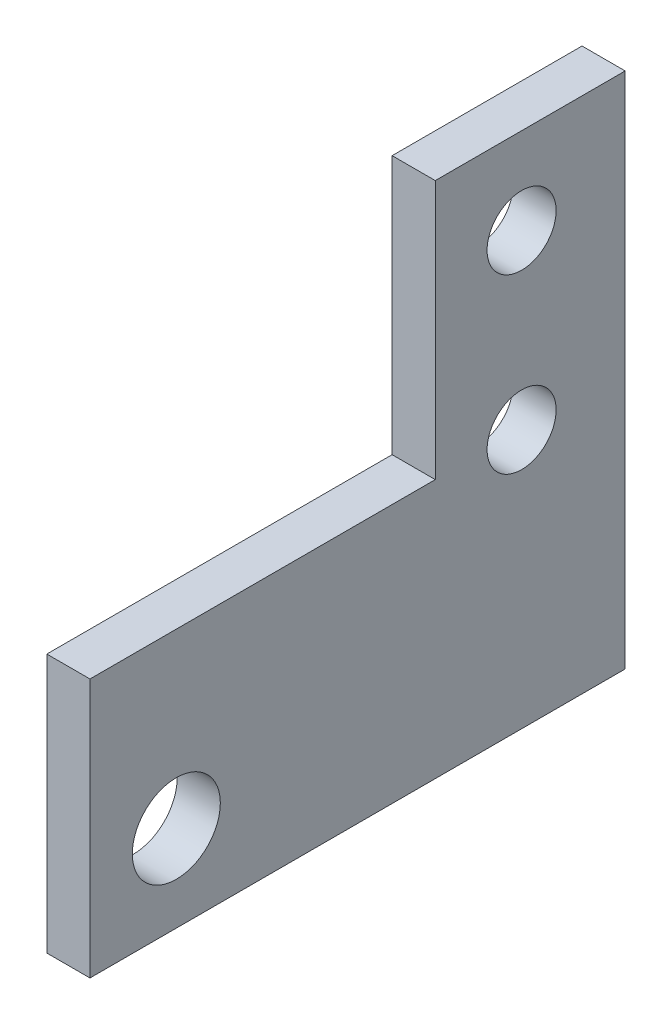
ISO-10303-21;
HEADER;
FILE_DESCRIPTION(('STEP AP214'),'2;1');
FILE_NAME('part.step','',(''),(''),'','','');
FILE_SCHEMA(('AUTOMOTIVE_DESIGN { 1 0 10303 214 1 1 1 1 }'));
ENDSEC;
DATA;
#1=APPLICATION_CONTEXT('core data for automotive mechanical design processes');
#2=APPLICATION_PROTOCOL_DEFINITION('international standard','automotive_design',2000,#1);
#3=PRODUCT_CONTEXT('',#1,'mechanical');
#4=PRODUCT('Part','Part','',(#3));
#5=PRODUCT_RELATED_PRODUCT_CATEGORY('part','',(#4));
#6=PRODUCT_DEFINITION_FORMATION('','',#4);
#7=PRODUCT_DEFINITION_CONTEXT('part definition',#1,'design');
#8=PRODUCT_DEFINITION('design','',#6,#7);
#9=PRODUCT_DEFINITION_SHAPE('','',#8);
#10=(LENGTH_UNIT() NAMED_UNIT(*) SI_UNIT(.MILLI.,.METRE.));
#11=(NAMED_UNIT(*) PLANE_ANGLE_UNIT() SI_UNIT($,.RADIAN.));
#12=(NAMED_UNIT(*) SI_UNIT($,.STERADIAN.) SOLID_ANGLE_UNIT());
#13=UNCERTAINTY_MEASURE_WITH_UNIT(LENGTH_MEASURE(1.E-05),#10,'distance_accuracy_value','');
#14=(GEOMETRIC_REPRESENTATION_CONTEXT(3) GLOBAL_UNCERTAINTY_ASSIGNED_CONTEXT((#13)) GLOBAL_UNIT_ASSIGNED_CONTEXT((#10,
#11,#12)) REPRESENTATION_CONTEXT('',''));
#15=CARTESIAN_POINT('',(0.,0.,0.));
#16=DIRECTION('',(0.,0.,1.));
#17=DIRECTION('',(1.,0.,0.));
#18=AXIS2_PLACEMENT_3D('',#15,#16,#17);
#19=CARTESIAN_POINT('',(5.,0.,0.));
#20=DIRECTION('',(1.,0.,0.));
#21=DIRECTION('',(0.,0.,-1.));
#22=AXIS2_PLACEMENT_3D('',#19,#20,#21);
#23=PLANE('',#22);
#24=CARTESIAN_POINT('',(5.,20.,-40.));
#25=DIRECTION('',(1.,0.,0.));
#26=DIRECTION('',(0.,0.,-1.));
#27=AXIS2_PLACEMENT_3D('',#24,#25,#26);
#28=CIRCLE('',#27,4.00000000000001);
#29=CARTESIAN_POINT('',(5.,20.,-44.));
#30=VERTEX_POINT('',#29);
#31=EDGE_CURVE('E184',#30,#30,#28,.T.);
#32=ORIENTED_EDGE('',*,*,#31,.F.);
#33=EDGE_LOOP('',(#32));
#34=FACE_BOUND('',#33,.T.);
#35=DIRECTION('',(0.,0.,1.));
#36=VECTOR('',#35,1.);
#37=CARTESIAN_POINT('',(5.,20.,-30.));
#38=LINE('',#37,#36);
#39=CARTESIAN_POINT('',(5.,20.,-30.));
#40=VERTEX_POINT('',#39);
#41=CARTESIAN_POINT('',(5.,20.,10.));
#42=VERTEX_POINT('',#41);
#43=EDGE_CURVE('E129',#40,#42,#38,.T.);
#44=ORIENTED_EDGE('',*,*,#43,.T.);
#45=DIRECTION('',(0.,-1.,0.));
#46=VECTOR('',#45,1.);
#47=CARTESIAN_POINT('',(5.,20.,10.));
#48=LINE('',#47,#46);
#49=CARTESIAN_POINT('',(5.,-9.99999999999999,10.));
#50=VERTEX_POINT('',#49);
#51=EDGE_CURVE('E87',#42,#50,#48,.T.);
#52=ORIENTED_EDGE('',*,*,#51,.T.);
#53=DIRECTION('',(0.,0.,-1.));
#54=VECTOR('',#53,1.);
#55=CARTESIAN_POINT('',(5.,-9.99999999999999,10.));
#56=LINE('',#55,#54);
#57=CARTESIAN_POINT('',(5.,-9.99999999999999,-52.));
#58=VERTEX_POINT('',#57);
#59=EDGE_CURVE('E100',#50,#58,#56,.T.);
#60=ORIENTED_EDGE('',*,*,#59,.T.);
#61=DIRECTION('',(0.,1.,0.));
#62=VECTOR('',#61,1.);
#63=CARTESIAN_POINT('',(5.,-9.99999999999999,-52.));
#64=LINE('',#63,#62);
#65=CARTESIAN_POINT('',(5.,50.,-52.));
#66=VERTEX_POINT('',#65);
#67=EDGE_CURVE('E94',#58,#66,#64,.T.);
#68=ORIENTED_EDGE('',*,*,#67,.T.);
#69=DIRECTION('',(0.,0.,1.));
#70=VECTOR('',#69,1.);
#71=CARTESIAN_POINT('',(5.,50.,-52.));
#72=LINE('',#71,#70);
#73=CARTESIAN_POINT('',(5.,50.,-30.));
#74=VERTEX_POINT('',#73);
#75=EDGE_CURVE('E98',#66,#74,#72,.T.);
#76=ORIENTED_EDGE('',*,*,#75,.T.);
#77=DIRECTION('',(0.,-1.,0.));
#78=VECTOR('',#77,1.);
#79=CARTESIAN_POINT('',(5.,50.,-30.));
#80=LINE('',#79,#78);
#81=EDGE_CURVE('E50',#74,#40,#80,.T.);
#82=ORIENTED_EDGE('',*,*,#81,.T.);
#83=EDGE_LOOP('',(#44,#52,#60,#68,#76,#82));
#84=FACE_BOUND('',#83,.T.);
#85=CARTESIAN_POINT('',(5.,40.,-40.));
#86=DIRECTION('',(1.,0.,0.));
#87=DIRECTION('',(0.,0.,-1.));
#88=AXIS2_PLACEMENT_3D('',#85,#86,#87);
#89=CIRCLE('',#88,4.00000000000001);
#90=CARTESIAN_POINT('',(5.,40.,-44.));
#91=VERTEX_POINT('',#90);
#92=EDGE_CURVE('E122',#91,#91,#89,.T.);
#93=ORIENTED_EDGE('',*,*,#92,.F.);
#94=EDGE_LOOP('',(#93));
#95=FACE_BOUND('',#94,.T.);
#96=CARTESIAN_POINT('',(5.,0.,0.));
#97=DIRECTION('',(1.,0.,0.));
#98=DIRECTION('',(0.,0.,-1.));
#99=AXIS2_PLACEMENT_3D('',#96,#97,#98);
#100=CIRCLE('',#99,5.1);
#101=CARTESIAN_POINT('',(5.,0.,-5.1));
#102=VERTEX_POINT('',#101);
#103=EDGE_CURVE('E175',#102,#102,#100,.T.);
#104=ORIENTED_EDGE('',*,*,#103,.F.);
#105=EDGE_LOOP('',(#104));
#106=FACE_BOUND('',#105,.T.);
#107=ADVANCED_FACE('F33',(#34,#84,#95,#106),#23,.T.);
#108=CARTESIAN_POINT('',(0.,0.,0.));
#109=DIRECTION('',(1.,0.,0.));
#110=DIRECTION('',(0.,0.,-1.));
#111=AXIS2_PLACEMENT_3D('',#108,#109,#110);
#112=PLANE('',#111);
#113=DIRECTION('',(0.,0.,1.));
#114=VECTOR('',#113,1.);
#115=CARTESIAN_POINT('',(0.,20.,-30.));
#116=LINE('',#115,#114);
#117=CARTESIAN_POINT('',(0.,20.,-30.));
#118=VERTEX_POINT('',#117);
#119=CARTESIAN_POINT('',(0.,20.,10.));
#120=VERTEX_POINT('',#119);
#121=EDGE_CURVE('E118',#118,#120,#116,.T.);
#122=ORIENTED_EDGE('',*,*,#121,.F.);
#123=DIRECTION('',(0.,-1.,0.));
#124=VECTOR('',#123,1.);
#125=CARTESIAN_POINT('',(0.,50.,-30.));
#126=LINE('',#125,#124);
#127=CARTESIAN_POINT('',(0.,50.,-30.));
#128=VERTEX_POINT('',#127);
#129=EDGE_CURVE('E79',#128,#118,#126,.T.);
#130=ORIENTED_EDGE('',*,*,#129,.F.);
#131=DIRECTION('',(0.,0.,1.));
#132=VECTOR('',#131,1.);
#133=CARTESIAN_POINT('',(0.,50.,-52.));
#134=LINE('',#133,#132);
#135=CARTESIAN_POINT('',(0.,50.,-52.));
#136=VERTEX_POINT('',#135);
#137=EDGE_CURVE('E73',#136,#128,#134,.T.);
#138=ORIENTED_EDGE('',*,*,#137,.F.);
#139=DIRECTION('',(0.,1.,0.));
#140=VECTOR('',#139,1.);
#141=CARTESIAN_POINT('',(0.,-9.99999999999999,-52.));
#142=LINE('',#141,#140);
#143=CARTESIAN_POINT('',(0.,-9.99999999999999,-52.));
#144=VERTEX_POINT('',#143);
#145=EDGE_CURVE('E108',#144,#136,#142,.T.);
#146=ORIENTED_EDGE('',*,*,#145,.F.);
#147=DIRECTION('',(0.,0.,-1.));
#148=VECTOR('',#147,1.);
#149=CARTESIAN_POINT('',(0.,-9.99999999999999,10.));
#150=LINE('',#149,#148);
#151=CARTESIAN_POINT('',(0.,-9.99999999999999,10.));
#152=VERTEX_POINT('',#151);
#153=EDGE_CURVE('E124',#152,#144,#150,.T.);
#154=ORIENTED_EDGE('',*,*,#153,.F.);
#155=DIRECTION('',(0.,-1.,0.));
#156=VECTOR('',#155,1.);
#157=CARTESIAN_POINT('',(0.,20.,10.));
#158=LINE('',#157,#156);
#159=EDGE_CURVE('E121',#120,#152,#158,.T.);
#160=ORIENTED_EDGE('',*,*,#159,.F.);
#161=EDGE_LOOP('',(#122,#130,#138,#146,#154,#160));
#162=FACE_BOUND('',#161,.T.);
#163=CARTESIAN_POINT('',(0.,40.,-40.));
#164=DIRECTION('',(1.,0.,0.));
#165=DIRECTION('',(0.,0.,-1.));
#166=AXIS2_PLACEMENT_3D('',#163,#164,#165);
#167=CIRCLE('',#166,4.00000000000001);
#168=CARTESIAN_POINT('',(0.,40.,-44.));
#169=VERTEX_POINT('',#168);
#170=EDGE_CURVE('E187',#169,#169,#167,.T.);
#171=ORIENTED_EDGE('',*,*,#170,.T.);
#172=EDGE_LOOP('',(#171));
#173=FACE_BOUND('',#172,.T.);
#174=CARTESIAN_POINT('',(0.,20.,-40.));
#175=DIRECTION('',(1.,0.,0.));
#176=DIRECTION('',(0.,0.,-1.));
#177=AXIS2_PLACEMENT_3D('',#174,#175,#176);
#178=CIRCLE('',#177,4.00000000000001);
#179=CARTESIAN_POINT('',(0.,20.,-44.));
#180=VERTEX_POINT('',#179);
#181=EDGE_CURVE('E181',#180,#180,#178,.T.);
#182=ORIENTED_EDGE('',*,*,#181,.T.);
#183=EDGE_LOOP('',(#182));
#184=FACE_BOUND('',#183,.T.);
#185=CARTESIAN_POINT('',(0.,0.,0.));
#186=DIRECTION('',(1.,0.,0.));
#187=DIRECTION('',(0.,0.,-1.));
#188=AXIS2_PLACEMENT_3D('',#185,#186,#187);
#189=CIRCLE('',#188,5.1);
#190=CARTESIAN_POINT('',(0.,0.,-5.1));
#191=VERTEX_POINT('',#190);
#192=EDGE_CURVE('E178',#191,#191,#189,.T.);
#193=ORIENTED_EDGE('',*,*,#192,.T.);
#194=EDGE_LOOP('',(#193));
#195=FACE_BOUND('',#194,.T.);
#196=ADVANCED_FACE('F138',(#162,#173,#184,#195),#112,.F.);
#197=CARTESIAN_POINT('',(5.,20.,-30.));
#198=DIRECTION('',(0.,-1.,0.));
#199=DIRECTION('',(0.,0.,-1.));
#200=AXIS2_PLACEMENT_3D('',#197,#198,#199);
#201=PLANE('',#200);
#202=ORIENTED_EDGE('',*,*,#121,.T.);
#203=DIRECTION('',(-1.,0.,0.));
#204=VECTOR('',#203,1.);
#205=CARTESIAN_POINT('',(5.,20.,10.));
#206=LINE('',#205,#204);
#207=EDGE_CURVE('E11',#42,#120,#206,.T.);
#208=ORIENTED_EDGE('',*,*,#207,.F.);
#209=ORIENTED_EDGE('',*,*,#43,.F.);
#210=DIRECTION('',(-1.,0.,0.));
#211=VECTOR('',#210,1.);
#212=CARTESIAN_POINT('',(5.,20.,-30.));
#213=LINE('',#212,#211);
#214=EDGE_CURVE('E114',#40,#118,#213,.T.);
#215=ORIENTED_EDGE('',*,*,#214,.T.);
#216=EDGE_LOOP('',(#202,#208,#209,#215));
#217=FACE_BOUND('',#216,.T.);
#218=ADVANCED_FACE('F35',(#217),#201,.F.);
#219=CARTESIAN_POINT('',(5.,20.,10.));
#220=DIRECTION('',(0.,0.,-1.));
#221=DIRECTION('',(-1.,0.,0.));
#222=AXIS2_PLACEMENT_3D('',#219,#220,#221);
#223=PLANE('',#222);
#224=ORIENTED_EDGE('',*,*,#159,.T.);
#225=DIRECTION('',(-1.,0.,0.));
#226=VECTOR('',#225,1.);
#227=CARTESIAN_POINT('',(5.,-9.99999999999999,10.));
#228=LINE('',#227,#226);
#229=EDGE_CURVE('E42',#50,#152,#228,.T.);
#230=ORIENTED_EDGE('',*,*,#229,.F.);
#231=ORIENTED_EDGE('',*,*,#51,.F.);
#232=ORIENTED_EDGE('',*,*,#207,.T.);
#233=EDGE_LOOP('',(#224,#230,#231,#232));
#234=FACE_BOUND('',#233,.T.);
#235=ADVANCED_FACE('F237',(#234),#223,.F.);
#236=CARTESIAN_POINT('',(5.,-9.99999999999999,10.));
#237=DIRECTION('',(0.,1.,0.));
#238=DIRECTION('',(0.,0.,1.));
#239=AXIS2_PLACEMENT_3D('',#236,#237,#238);
#240=PLANE('',#239);
#241=ORIENTED_EDGE('',*,*,#153,.T.);
#242=DIRECTION('',(-1.,0.,0.));
#243=VECTOR('',#242,1.);
#244=CARTESIAN_POINT('',(5.,-9.99999999999999,-52.));
#245=LINE('',#244,#243);
#246=EDGE_CURVE('E109',#58,#144,#245,.T.);
#247=ORIENTED_EDGE('',*,*,#246,.F.);
#248=ORIENTED_EDGE('',*,*,#59,.F.);
#249=ORIENTED_EDGE('',*,*,#229,.T.);
#250=EDGE_LOOP('',(#241,#247,#248,#249));
#251=FACE_BOUND('',#250,.T.);
#252=ADVANCED_FACE('F135',(#251),#240,.F.);
#253=CARTESIAN_POINT('',(5.,-9.99999999999999,-52.));
#254=DIRECTION('',(0.,0.,1.));
#255=DIRECTION('',(0.,-1.,0.));
#256=AXIS2_PLACEMENT_3D('',#253,#254,#255);
#257=PLANE('',#256);
#258=ORIENTED_EDGE('',*,*,#145,.T.);
#259=DIRECTION('',(-1.,0.,0.));
#260=VECTOR('',#259,1.);
#261=CARTESIAN_POINT('',(5.,50.,-52.));
#262=LINE('',#261,#260);
#263=EDGE_CURVE('E105',#66,#136,#262,.T.);
#264=ORIENTED_EDGE('',*,*,#263,.F.);
#265=ORIENTED_EDGE('',*,*,#67,.F.);
#266=ORIENTED_EDGE('',*,*,#246,.T.);
#267=EDGE_LOOP('',(#258,#264,#265,#266));
#268=FACE_BOUND('',#267,.T.);
#269=ADVANCED_FACE('F106',(#268),#257,.F.);
#270=CARTESIAN_POINT('',(5.,50.,-52.));
#271=DIRECTION('',(0.,-1.,0.));
#272=DIRECTION('',(0.,0.,-1.));
#273=AXIS2_PLACEMENT_3D('',#270,#271,#272);
#274=PLANE('',#273);
#275=ORIENTED_EDGE('',*,*,#137,.T.);
#276=DIRECTION('',(-1.,0.,0.));
#277=VECTOR('',#276,1.);
#278=CARTESIAN_POINT('',(5.,50.,-30.));
#279=LINE('',#278,#277);
#280=EDGE_CURVE('E110',#74,#128,#279,.T.);
#281=ORIENTED_EDGE('',*,*,#280,.F.);
#282=ORIENTED_EDGE('',*,*,#75,.F.);
#283=ORIENTED_EDGE('',*,*,#263,.T.);
#284=EDGE_LOOP('',(#275,#281,#282,#283));
#285=FACE_BOUND('',#284,.T.);
#286=ADVANCED_FACE('F112',(#285),#274,.F.);
#287=CARTESIAN_POINT('',(5.,50.,-30.));
#288=DIRECTION('',(0.,0.,-1.));
#289=DIRECTION('',(0.,1.,0.));
#290=AXIS2_PLACEMENT_3D('',#287,#288,#289);
#291=PLANE('',#290);
#292=ORIENTED_EDGE('',*,*,#129,.T.);
#293=ORIENTED_EDGE('',*,*,#214,.F.);
#294=ORIENTED_EDGE('',*,*,#81,.F.);
#295=ORIENTED_EDGE('',*,*,#280,.T.);
#296=EDGE_LOOP('',(#292,#293,#294,#295));
#297=FACE_BOUND('',#296,.T.);
#298=ADVANCED_FACE('F143',(#297),#291,.F.);
#299=CARTESIAN_POINT('',(5.,40.,-40.));
#300=DIRECTION('',(-1.,0.,0.));
#301=DIRECTION('',(0.,0.,1.));
#302=AXIS2_PLACEMENT_3D('',#299,#300,#301);
#303=CYLINDRICAL_SURFACE('',#302,4.00000000000001);
#304=ORIENTED_EDGE('',*,*,#92,.T.);
#305=EDGE_LOOP('',(#304));
#306=FACE_BOUND('',#305,.T.);
#307=ORIENTED_EDGE('',*,*,#170,.F.);
#308=EDGE_LOOP('',(#307));
#309=FACE_BOUND('',#308,.T.);
#310=ADVANCED_FACE('F145',(#306,#309),#303,.F.);
#311=CARTESIAN_POINT('',(5.,20.,-40.));
#312=DIRECTION('',(-1.,0.,0.));
#313=DIRECTION('',(0.,0.,1.));
#314=AXIS2_PLACEMENT_3D('',#311,#312,#313);
#315=CYLINDRICAL_SURFACE('',#314,4.00000000000001);
#316=ORIENTED_EDGE('',*,*,#31,.T.);
#317=EDGE_LOOP('',(#316));
#318=FACE_BOUND('',#317,.T.);
#319=ORIENTED_EDGE('',*,*,#181,.F.);
#320=EDGE_LOOP('',(#319));
#321=FACE_BOUND('',#320,.T.);
#322=ADVANCED_FACE('F151',(#318,#321),#315,.F.);
#323=CARTESIAN_POINT('',(5.,0.,0.));
#324=DIRECTION('',(-1.,0.,0.));
#325=DIRECTION('',(0.,0.,1.));
#326=AXIS2_PLACEMENT_3D('',#323,#324,#325);
#327=CYLINDRICAL_SURFACE('',#326,5.1);
#328=ORIENTED_EDGE('',*,*,#103,.T.);
#329=EDGE_LOOP('',(#328));
#330=FACE_BOUND('',#329,.T.);
#331=ORIENTED_EDGE('',*,*,#192,.F.);
#332=EDGE_LOOP('',(#331));
#333=FACE_BOUND('',#332,.T.);
#334=ADVANCED_FACE('F166',(#330,#333),#327,.F.);
#335=CLOSED_SHELL('',(#107,#196,#218,#235,#252,#269,#286,#298,#310,#322,#334));
#336=MANIFOLD_SOLID_BREP('B2',#335);
#337=ADVANCED_BREP_SHAPE_REPRESENTATION('',(#18,#336),#14);
#338=SHAPE_DEFINITION_REPRESENTATION(#9,#337);
ENDSEC;
END-ISO-10303-21;
